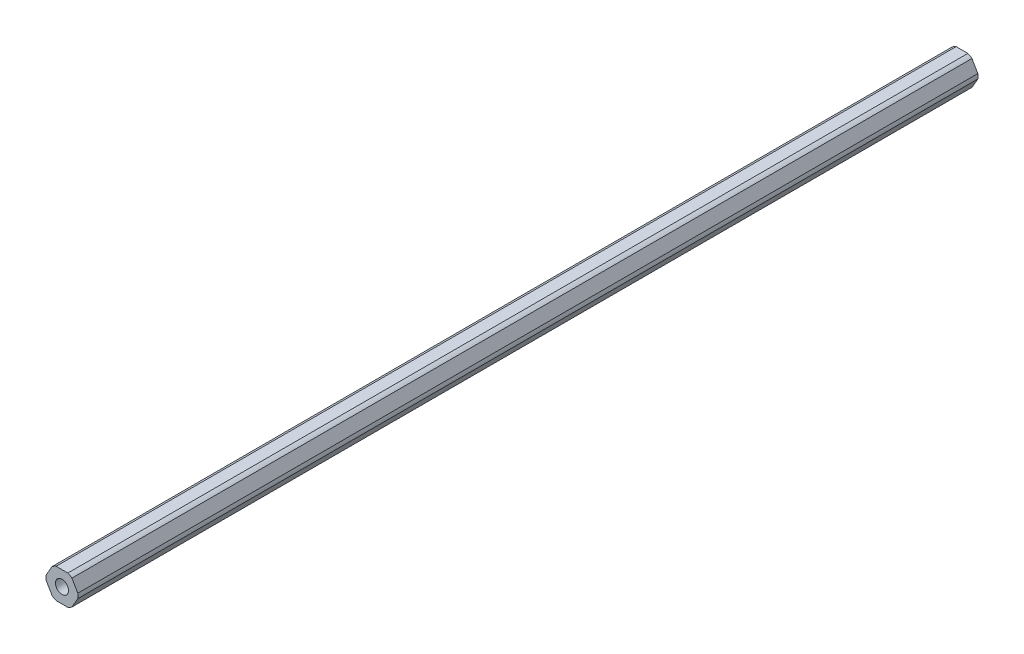
ISO-10303-21;
HEADER;
FILE_DESCRIPTION(('STEP AP214'),'2;1');
FILE_NAME('part.step','',(''),(''),'','','');
FILE_SCHEMA(('AUTOMOTIVE_DESIGN { 1 0 10303 214 1 1 1 1 }'));
ENDSEC;
DATA;
#1=APPLICATION_CONTEXT('core data for automotive mechanical design processes');
#2=APPLICATION_PROTOCOL_DEFINITION('international standard','automotive_design',2000,#1);
#3=PRODUCT_CONTEXT('',#1,'mechanical');
#4=PRODUCT('Part','Part','',(#3));
#5=PRODUCT_RELATED_PRODUCT_CATEGORY('part','',(#4));
#6=PRODUCT_DEFINITION_FORMATION('','',#4);
#7=PRODUCT_DEFINITION_CONTEXT('part definition',#1,'design');
#8=PRODUCT_DEFINITION('design','',#6,#7);
#9=PRODUCT_DEFINITION_SHAPE('','',#8);
#10=(LENGTH_UNIT() NAMED_UNIT(*) SI_UNIT(.MILLI.,.METRE.));
#11=(NAMED_UNIT(*) PLANE_ANGLE_UNIT() SI_UNIT($,.RADIAN.));
#12=(NAMED_UNIT(*) SI_UNIT($,.STERADIAN.) SOLID_ANGLE_UNIT());
#13=UNCERTAINTY_MEASURE_WITH_UNIT(LENGTH_MEASURE(1.E-05),#10,'distance_accuracy_value','');
#14=(GEOMETRIC_REPRESENTATION_CONTEXT(3) GLOBAL_UNCERTAINTY_ASSIGNED_CONTEXT((#13)) GLOBAL_UNIT_ASSIGNED_CONTEXT((#10,
#11,#12)) REPRESENTATION_CONTEXT('',''));
#15=CARTESIAN_POINT('',(0.,0.,0.));
#16=DIRECTION('',(0.,0.,1.));
#17=DIRECTION('',(1.,0.,0.));
#18=AXIS2_PLACEMENT_3D('',#15,#16,#17);
#19=CARTESIAN_POINT('',(2.74963065701564,-4.7625,457.2));
#20=DIRECTION('',(-0.866025403784442,0.5,0.));
#21=DIRECTION('',(0.,0.,1.));
#22=AXIS2_PLACEMENT_3D('',#19,#20,#21);
#23=PLANE('',#22);
#24=DIRECTION('',(0.499999999999991,0.866025403784444,0.));
#25=VECTOR('',#24,1.);
#26=CARTESIAN_POINT('',(3.18463300545771,-4.00905383108654,-304.8));
#27=LINE('',#26,#25);
#28=CARTESIAN_POINT('',(3.18463300545771,-4.00905383108654,-304.8));
#29=VERTEX_POINT('',#28);
#30=CARTESIAN_POINT('',(5.06425896558911,-0.753446168913433,-304.8));
#31=VERTEX_POINT('',#30);
#32=EDGE_CURVE('E238',#29,#31,#27,.T.);
#33=ORIENTED_EDGE('',*,*,#32,.F.);
#34=DIRECTION('',(0.,0.,1.));
#35=VECTOR('',#34,1.);
#36=CARTESIAN_POINT('',(3.1846330054577,-4.00905383108652,-457.2));
#37=LINE('',#36,#35);
#38=CARTESIAN_POINT('',(3.1846330054577,-4.00905383108653,-592.867499999751));
#39=VERTEX_POINT('',#38);
#40=EDGE_CURVE('E250',#39,#29,#37,.T.);
#41=ORIENTED_EDGE('',*,*,#40,.F.);
#42=DIRECTION('',(-0.499999999999995,-0.866025403784442,0.));
#43=VECTOR('',#42,1.);
#44=CARTESIAN_POINT('',(5.0642589655891,-0.753446168913447,-592.867499999751));
#45=LINE('',#44,#43);
#46=CARTESIAN_POINT('',(5.06425896558911,-0.753446168913432,-592.867499999751));
#47=VERTEX_POINT('',#46);
#48=EDGE_CURVE('E211',#47,#39,#45,.T.);
#49=ORIENTED_EDGE('',*,*,#48,.F.);
#50=DIRECTION('',(0.,0.,-1.));
#51=VECTOR('',#50,1.);
#52=CARTESIAN_POINT('',(5.06425896558911,-0.753446168913433,-457.2));
#53=LINE('',#52,#51);
#54=EDGE_CURVE('E270',#31,#47,#53,.T.);
#55=ORIENTED_EDGE('',*,*,#54,.F.);
#56=EDGE_LOOP('',(#33,#41,#49,#55));
#57=FACE_BOUND('',#56,.T.);
#58=ADVANCED_FACE('F49',(#57),#23,.F.);
#59=CARTESIAN_POINT('',(5.49926131403117,0.,457.2));
#60=DIRECTION('',(-0.866025403784438,-0.5,0.));
#61=DIRECTION('',(-0.5,0.866025403784438,0.));
#62=AXIS2_PLACEMENT_3D('',#59,#60,#61);
#63=PLANE('',#62);
#64=DIRECTION('',(-0.500000000000001,0.866025403784438,0.));
#65=VECTOR('',#64,1.);
#66=CARTESIAN_POINT('',(5.06425896558911,0.753446168913416,-304.8));
#67=LINE('',#66,#65);
#68=CARTESIAN_POINT('',(5.06425896558911,0.753446168913416,-304.8));
#69=VERTEX_POINT('',#68);
#70=CARTESIAN_POINT('',(3.18463300545762,4.00905383108658,-304.8));
#71=VERTEX_POINT('',#70);
#72=EDGE_CURVE('E66',#69,#71,#67,.T.);
#73=ORIENTED_EDGE('',*,*,#72,.F.);
#74=DIRECTION('',(0.,0.,1.));
#75=VECTOR('',#74,1.);
#76=CARTESIAN_POINT('',(5.06425896558911,0.753446168913412,-457.2));
#77=LINE('',#76,#75);
#78=CARTESIAN_POINT('',(5.06425896558911,0.753446168913415,-592.867499999751));
#79=VERTEX_POINT('',#78);
#80=EDGE_CURVE('E267',#79,#69,#77,.T.);
#81=ORIENTED_EDGE('',*,*,#80,.F.);
#82=DIRECTION('',(0.499999999999999,-0.866025403784439,0.));
#83=VECTOR('',#82,1.);
#84=CARTESIAN_POINT('',(3.18463300545762,4.00905383108659,-592.867499999751));
#85=LINE('',#84,#83);
#86=CARTESIAN_POINT('',(3.18463300545763,4.00905383108658,-592.867499999751));
#87=VERTEX_POINT('',#86);
#88=EDGE_CURVE('E182',#87,#79,#85,.T.);
#89=ORIENTED_EDGE('',*,*,#88,.F.);
#90=DIRECTION('',(0.,0.,-1.));
#91=VECTOR('',#90,1.);
#92=CARTESIAN_POINT('',(3.18463300545762,4.00905383108658,-457.2));
#93=LINE('',#92,#91);
#94=EDGE_CURVE('E171',#71,#87,#93,.T.);
#95=ORIENTED_EDGE('',*,*,#94,.F.);
#96=EDGE_LOOP('',(#73,#81,#89,#95));
#97=FACE_BOUND('',#96,.T.);
#98=ADVANCED_FACE('F299',(#97),#63,.F.);
#99=CARTESIAN_POINT('',(2.74963065701557,4.7625,457.2));
#100=DIRECTION('',(0.,-1.,0.));
#101=DIRECTION('',(0.,0.,-1.));
#102=AXIS2_PLACEMENT_3D('',#99,#100,#101);
#103=PLANE('',#102);
#104=DIRECTION('',(-1.,0.,0.));
#105=VECTOR('',#104,1.);
#106=CARTESIAN_POINT('',(1.87962596013146,4.76249999999999,-304.8));
#107=LINE('',#106,#105);
#108=CARTESIAN_POINT('',(1.87962596013146,4.76249999999999,-304.8));
#109=VERTEX_POINT('',#108);
#110=CARTESIAN_POINT('',(-1.8796259601315,4.7625,-304.8));
#111=VERTEX_POINT('',#110);
#112=EDGE_CURVE('E168',#109,#111,#107,.T.);
#113=ORIENTED_EDGE('',*,*,#112,.F.);
#114=DIRECTION('',(0.,0.,1.));
#115=VECTOR('',#114,1.);
#116=CARTESIAN_POINT('',(1.87962596013147,4.7625,-457.2));
#117=LINE('',#116,#115);
#118=CARTESIAN_POINT('',(1.87962596013146,4.76249999999999,-592.867499999751));
#119=VERTEX_POINT('',#118);
#120=EDGE_CURVE('E161',#119,#109,#117,.T.);
#121=ORIENTED_EDGE('',*,*,#120,.F.);
#122=DIRECTION('',(1.,0.,0.));
#123=VECTOR('',#122,1.);
#124=CARTESIAN_POINT('',(-1.87962596013152,4.76249999999999,-592.867499999751));
#125=LINE('',#124,#123);
#126=CARTESIAN_POINT('',(-1.8796259601315,4.76249999999999,-592.867499999751));
#127=VERTEX_POINT('',#126);
#128=EDGE_CURVE('E166',#127,#119,#125,.T.);
#129=ORIENTED_EDGE('',*,*,#128,.F.);
#130=DIRECTION('',(0.,0.,-1.));
#131=VECTOR('',#130,1.);
#132=CARTESIAN_POINT('',(-1.8796259601315,4.7625,-457.2));
#133=LINE('',#132,#131);
#134=EDGE_CURVE('E246',#111,#127,#133,.T.);
#135=ORIENTED_EDGE('',*,*,#134,.F.);
#136=EDGE_LOOP('',(#113,#121,#129,#135));
#137=FACE_BOUND('',#136,.T.);
#138=ADVANCED_FACE('F163',(#137),#103,.F.);
#139=CARTESIAN_POINT('',(-2.7496306570156,4.7625,457.2));
#140=DIRECTION('',(0.866025403784442,-0.5,0.));
#141=DIRECTION('',(0.,0.,-1.));
#142=AXIS2_PLACEMENT_3D('',#139,#140,#141);
#143=PLANE('',#142);
#144=DIRECTION('',(-0.499999999999993,-0.866025403784443,0.));
#145=VECTOR('',#144,1.);
#146=CARTESIAN_POINT('',(-3.18463300545766,4.00905383108656,-304.8));
#147=LINE('',#146,#145);
#148=CARTESIAN_POINT('',(-3.18463300545767,4.00905383108657,-304.8));
#149=VERTEX_POINT('',#148);
#150=CARTESIAN_POINT('',(-5.06425896558912,0.753446168913382,-304.8));
#151=VERTEX_POINT('',#150);
#152=EDGE_CURVE('E226',#149,#151,#147,.T.);
#153=ORIENTED_EDGE('',*,*,#152,.F.);
#154=DIRECTION('',(0.,0.,1.));
#155=VECTOR('',#154,1.);
#156=CARTESIAN_POINT('',(-3.18463300545766,4.00905383108655,-457.2));
#157=LINE('',#156,#155);
#158=CARTESIAN_POINT('',(-3.18463300545766,4.00905383108656,-592.867499999751));
#159=VERTEX_POINT('',#158);
#160=EDGE_CURVE('E253',#159,#149,#157,.T.);
#161=ORIENTED_EDGE('',*,*,#160,.F.);
#162=DIRECTION('',(0.499999999999995,0.866025403784441,0.));
#163=VECTOR('',#162,1.);
#164=CARTESIAN_POINT('',(-5.06425896558913,0.753446168913367,-592.867499999751));
#165=LINE('',#164,#163);
#166=CARTESIAN_POINT('',(-5.06425896558912,0.753446168913381,-592.867499999751));
#167=VERTEX_POINT('',#166);
#168=EDGE_CURVE('E190',#167,#159,#165,.T.);
#169=ORIENTED_EDGE('',*,*,#168,.F.);
#170=DIRECTION('',(0.,0.,-1.));
#171=VECTOR('',#170,1.);
#172=CARTESIAN_POINT('',(-5.06425896558912,0.753446168913382,-457.2));
#173=LINE('',#172,#171);
#174=EDGE_CURVE('E245',#151,#167,#173,.T.);
#175=ORIENTED_EDGE('',*,*,#174,.F.);
#176=EDGE_LOOP('',(#153,#161,#169,#175));
#177=FACE_BOUND('',#176,.T.);
#178=ADVANCED_FACE('F329',(#177),#143,.F.);
#179=CARTESIAN_POINT('',(-5.49926131403117,0.,457.2));
#180=DIRECTION('',(0.866025403784435,0.500000000000007,0.));
#181=DIRECTION('',(0.,0.,-1.));
#182=AXIS2_PLACEMENT_3D('',#179,#180,#181);
#183=PLANE('',#182);
#184=DIRECTION('',(0.500000000000007,-0.866025403784435,0.));
#185=VECTOR('',#184,1.);
#186=CARTESIAN_POINT('',(-5.06425896558911,-0.753446168913448,-304.8));
#187=LINE('',#186,#185);
#188=CARTESIAN_POINT('',(-5.06425896558911,-0.753446168913446,-304.8));
#189=VERTEX_POINT('',#188);
#190=CARTESIAN_POINT('',(-3.1846330054576,-4.0090538310866,-304.8));
#191=VERTEX_POINT('',#190);
#192=EDGE_CURVE('E230',#189,#191,#187,.T.);
#193=ORIENTED_EDGE('',*,*,#192,.F.);
#194=DIRECTION('',(0.,0.,1.));
#195=VECTOR('',#194,1.);
#196=CARTESIAN_POINT('',(-5.06425896558911,-0.75344616891345,-457.2));
#197=LINE('',#196,#195);
#198=CARTESIAN_POINT('',(-5.06425896558911,-0.75344616891345,-592.867499999751));
#199=VERTEX_POINT('',#198);
#200=EDGE_CURVE('E241',#199,#189,#197,.T.);
#201=ORIENTED_EDGE('',*,*,#200,.F.);
#202=DIRECTION('',(-0.500000000000007,0.866025403784434,0.));
#203=VECTOR('',#202,1.);
#204=CARTESIAN_POINT('',(-3.1846330054576,-4.00905383108659,-592.867499999751));
#205=LINE('',#204,#203);
#206=CARTESIAN_POINT('',(-3.1846330054576,-4.0090538310866,-592.867499999751));
#207=VERTEX_POINT('',#206);
#208=EDGE_CURVE('E199',#207,#199,#205,.T.);
#209=ORIENTED_EDGE('',*,*,#208,.F.);
#210=DIRECTION('',(0.,0.,-1.));
#211=VECTOR('',#210,1.);
#212=CARTESIAN_POINT('',(-3.1846330054576,-4.0090538310866,-457.2));
#213=LINE('',#212,#211);
#214=EDGE_CURVE('E251',#191,#207,#213,.T.);
#215=ORIENTED_EDGE('',*,*,#214,.F.);
#216=EDGE_LOOP('',(#193,#201,#209,#215));
#217=FACE_BOUND('',#216,.T.);
#218=ADVANCED_FACE('F320',(#217),#183,.F.);
#219=CARTESIAN_POINT('',(-2.74963065701554,-4.7625,457.2));
#220=DIRECTION('',(0.,1.,0.));
#221=DIRECTION('',(1.,0.,0.));
#222=AXIS2_PLACEMENT_3D('',#219,#220,#221);
#223=PLANE('',#222);
#224=DIRECTION('',(1.,0.,0.));
#225=VECTOR('',#224,1.);
#226=CARTESIAN_POINT('',(-1.87962596013144,-4.7625,-304.8));
#227=LINE('',#226,#225);
#228=CARTESIAN_POINT('',(-1.87962596013144,-4.7625,-304.8));
#229=VERTEX_POINT('',#228);
#230=CARTESIAN_POINT('',(1.87962596013154,-4.7625,-304.8));
#231=VERTEX_POINT('',#230);
#232=EDGE_CURVE('E234',#229,#231,#227,.T.);
#233=ORIENTED_EDGE('',*,*,#232,.F.);
#234=DIRECTION('',(0.,0.,1.));
#235=VECTOR('',#234,1.);
#236=CARTESIAN_POINT('',(-1.87962596013144,-4.7625,-457.2));
#237=LINE('',#236,#235);
#238=CARTESIAN_POINT('',(-1.87962596013143,-4.7625,-592.867499999751));
#239=VERTEX_POINT('',#238);
#240=EDGE_CURVE('E257',#239,#229,#237,.T.);
#241=ORIENTED_EDGE('',*,*,#240,.F.);
#242=DIRECTION('',(-1.,0.,0.));
#243=VECTOR('',#242,1.);
#244=CARTESIAN_POINT('',(1.8796259601315,-4.76249999999998,-592.867499999751));
#245=LINE('',#244,#243);
#246=CARTESIAN_POINT('',(1.87962596013153,-4.76249999999998,-592.867499999751));
#247=VERTEX_POINT('',#246);
#248=EDGE_CURVE('E205',#247,#239,#245,.T.);
#249=ORIENTED_EDGE('',*,*,#248,.F.);
#250=DIRECTION('',(0.,0.,-1.));
#251=VECTOR('',#250,1.);
#252=CARTESIAN_POINT('',(1.87962596013154,-4.7625,-457.2));
#253=LINE('',#252,#251);
#254=EDGE_CURVE('E247',#231,#247,#253,.T.);
#255=ORIENTED_EDGE('',*,*,#254,.F.);
#256=EDGE_LOOP('',(#233,#241,#249,#255));
#257=FACE_BOUND('',#256,.T.);
#258=ADVANCED_FACE('F312',(#257),#223,.F.);
#259=CARTESIAN_POINT('',(0.,0.,-457.2));
#260=DIRECTION('',(0.,0.,1.));
#261=DIRECTION('',(1.,0.,0.));
#262=AXIS2_PLACEMENT_3D('',#259,#260,#261);
#263=CYLINDRICAL_SURFACE('',#262,5.12);
#264=ORIENTED_EDGE('',*,*,#80,.T.);
#265=CARTESIAN_POINT('',(0.,0.,-304.8));
#266=DIRECTION('',(0.,0.,1.));
#267=DIRECTION('',(1.,0.,0.));
#268=AXIS2_PLACEMENT_3D('',#265,#266,#267);
#269=CIRCLE('',#268,5.12);
#270=CARTESIAN_POINT('',(5.12,0.,-304.8));
#271=VERTEX_POINT('',#270);
#272=EDGE_CURVE('E181',#271,#69,#269,.T.);
#273=ORIENTED_EDGE('',*,*,#272,.F.);
#274=DIRECTION('',(0.,0.,1.));
#275=VECTOR('',#274,1.);
#276=CARTESIAN_POINT('',(5.12,0.,-457.2));
#277=LINE('',#276,#275);
#278=CARTESIAN_POINT('',(5.12,0.,-457.2));
#279=VERTEX_POINT('',#278);
#280=EDGE_CURVE('E273',#279,#271,#277,.T.);
#281=ORIENTED_EDGE('',*,*,#280,.F.);
#282=ORIENTED_EDGE('',*,*,#280,.T.);
#283=EDGE_CURVE('E218',#31,#271,#269,.T.);
#284=ORIENTED_EDGE('',*,*,#283,.F.);
#285=ORIENTED_EDGE('',*,*,#54,.T.);
#286=CARTESIAN_POINT('',(0.,0.,-592.867499999751));
#287=DIRECTION('',(0.,0.,-1.));
#288=DIRECTION('',(-1.,0.,0.));
#289=AXIS2_PLACEMENT_3D('',#286,#287,#288);
#290=CIRCLE('',#289,5.12);
#291=EDGE_CURVE('E214',#79,#47,#290,.T.);
#292=ORIENTED_EDGE('',*,*,#291,.F.);
#293=EDGE_LOOP('',(#264,#273,#281,#282,#284,#285,#292));
#294=FACE_BOUND('',#293,.T.);
#295=ADVANCED_FACE('F51',(#294),#263,.T.);
#296=CARTESIAN_POINT('',(0.,0.,-457.2));
#297=DIRECTION('',(0.,0.,1.));
#298=DIRECTION('',(1.,0.,0.));
#299=AXIS2_PLACEMENT_3D('',#296,#297,#298);
#300=CYLINDRICAL_SURFACE('',#299,5.12);
#301=ORIENTED_EDGE('',*,*,#40,.T.);
#302=CARTESIAN_POINT('',(0.,0.,-304.8));
#303=DIRECTION('',(0.,0.,1.));
#304=DIRECTION('',(1.,0.,0.));
#305=AXIS2_PLACEMENT_3D('',#302,#303,#304);
#306=CIRCLE('',#305,5.12000000000003);
#307=EDGE_CURVE('E236',#231,#29,#306,.T.);
#308=ORIENTED_EDGE('',*,*,#307,.F.);
#309=ORIENTED_EDGE('',*,*,#254,.T.);
#310=CARTESIAN_POINT('',(0.,0.,-592.867499999751));
#311=DIRECTION('',(0.,0.,-1.));
#312=DIRECTION('',(-1.,0.,0.));
#313=AXIS2_PLACEMENT_3D('',#310,#311,#312);
#314=CIRCLE('',#313,5.12000000000001);
#315=EDGE_CURVE('E208',#39,#247,#314,.T.);
#316=ORIENTED_EDGE('',*,*,#315,.F.);
#317=EDGE_LOOP('',(#301,#308,#309,#316));
#318=FACE_BOUND('',#317,.T.);
#319=ADVANCED_FACE('F306',(#318),#300,.T.);
#320=CARTESIAN_POINT('',(0.,0.,-457.2));
#321=DIRECTION('',(0.,0.,1.));
#322=DIRECTION('',(1.,0.,0.));
#323=AXIS2_PLACEMENT_3D('',#320,#321,#322);
#324=CYLINDRICAL_SURFACE('',#323,5.12);
#325=ORIENTED_EDGE('',*,*,#240,.T.);
#326=CARTESIAN_POINT('',(0.,0.,-304.8));
#327=DIRECTION('',(0.,0.,1.));
#328=DIRECTION('',(1.,0.,0.));
#329=AXIS2_PLACEMENT_3D('',#326,#327,#328);
#330=CIRCLE('',#329,5.12);
#331=EDGE_CURVE('E232',#191,#229,#330,.T.);
#332=ORIENTED_EDGE('',*,*,#331,.F.);
#333=ORIENTED_EDGE('',*,*,#214,.T.);
#334=CARTESIAN_POINT('',(0.,0.,-592.867499999751));
#335=DIRECTION('',(0.,0.,-1.));
#336=DIRECTION('',(-1.,0.,0.));
#337=AXIS2_PLACEMENT_3D('',#334,#335,#336);
#338=CIRCLE('',#337,5.12);
#339=EDGE_CURVE('E202',#239,#207,#338,.T.);
#340=ORIENTED_EDGE('',*,*,#339,.F.);
#341=EDGE_LOOP('',(#325,#332,#333,#340));
#342=FACE_BOUND('',#341,.T.);
#343=ADVANCED_FACE('F315',(#342),#324,.T.);
#344=CARTESIAN_POINT('',(0.,0.,-457.2));
#345=DIRECTION('',(0.,0.,1.));
#346=DIRECTION('',(1.,0.,0.));
#347=AXIS2_PLACEMENT_3D('',#344,#345,#346);
#348=CYLINDRICAL_SURFACE('',#347,5.12);
#349=ORIENTED_EDGE('',*,*,#200,.T.);
#350=CARTESIAN_POINT('',(0.,0.,-304.8));
#351=DIRECTION('',(0.,0.,1.));
#352=DIRECTION('',(1.,0.,0.));
#353=AXIS2_PLACEMENT_3D('',#350,#351,#352);
#354=CIRCLE('',#353,5.12);
#355=EDGE_CURVE('E228',#151,#189,#354,.T.);
#356=ORIENTED_EDGE('',*,*,#355,.F.);
#357=ORIENTED_EDGE('',*,*,#174,.T.);
#358=CARTESIAN_POINT('',(0.,0.,-592.867499999751));
#359=DIRECTION('',(0.,0.,-1.));
#360=DIRECTION('',(-1.,0.,0.));
#361=AXIS2_PLACEMENT_3D('',#358,#359,#360);
#362=CIRCLE('',#361,5.12);
#363=EDGE_CURVE('E196',#199,#167,#362,.T.);
#364=ORIENTED_EDGE('',*,*,#363,.F.);
#365=EDGE_LOOP('',(#349,#356,#357,#364));
#366=FACE_BOUND('',#365,.T.);
#367=ADVANCED_FACE('F324',(#366),#348,.T.);
#368=CARTESIAN_POINT('',(0.,0.,-457.2));
#369=DIRECTION('',(0.,0.,1.));
#370=DIRECTION('',(1.,0.,0.));
#371=AXIS2_PLACEMENT_3D('',#368,#369,#370);
#372=CYLINDRICAL_SURFACE('',#371,5.12);
#373=ORIENTED_EDGE('',*,*,#160,.T.);
#374=CARTESIAN_POINT('',(0.,0.,-304.8));
#375=DIRECTION('',(0.,0.,1.));
#376=DIRECTION('',(1.,0.,0.));
#377=AXIS2_PLACEMENT_3D('',#374,#375,#376);
#378=CIRCLE('',#377,5.12000000000002);
#379=EDGE_CURVE('E224',#111,#149,#378,.T.);
#380=ORIENTED_EDGE('',*,*,#379,.F.);
#381=ORIENTED_EDGE('',*,*,#134,.T.);
#382=CARTESIAN_POINT('',(0.,0.,-592.867499999751));
#383=DIRECTION('',(0.,0.,-1.));
#384=DIRECTION('',(-1.,0.,0.));
#385=AXIS2_PLACEMENT_3D('',#382,#383,#384);
#386=CIRCLE('',#385,5.12000000000001);
#387=EDGE_CURVE('E187',#159,#127,#386,.T.);
#388=ORIENTED_EDGE('',*,*,#387,.F.);
#389=EDGE_LOOP('',(#373,#380,#381,#388));
#390=FACE_BOUND('',#389,.T.);
#391=ADVANCED_FACE('F332',(#390),#372,.T.);
#392=CARTESIAN_POINT('',(0.,0.,-457.2));
#393=DIRECTION('',(0.,0.,1.));
#394=DIRECTION('',(1.,0.,0.));
#395=AXIS2_PLACEMENT_3D('',#392,#393,#394);
#396=CYLINDRICAL_SURFACE('',#395,5.12);
#397=ORIENTED_EDGE('',*,*,#120,.T.);
#398=CARTESIAN_POINT('',(0.,0.,-304.8));
#399=DIRECTION('',(0.,0.,1.));
#400=DIRECTION('',(1.,0.,0.));
#401=AXIS2_PLACEMENT_3D('',#398,#399,#400);
#402=CIRCLE('',#401,5.12);
#403=EDGE_CURVE('E221',#71,#109,#402,.T.);
#404=ORIENTED_EDGE('',*,*,#403,.F.);
#405=ORIENTED_EDGE('',*,*,#94,.T.);
#406=CARTESIAN_POINT('',(0.,0.,-592.867499999751));
#407=DIRECTION('',(0.,0.,-1.));
#408=DIRECTION('',(-1.,0.,0.));
#409=AXIS2_PLACEMENT_3D('',#406,#407,#408);
#410=CIRCLE('',#409,5.12000000000001);
#411=EDGE_CURVE('E175',#119,#87,#410,.T.);
#412=ORIENTED_EDGE('',*,*,#411,.F.);
#413=EDGE_LOOP('',(#397,#404,#405,#412));
#414=FACE_BOUND('',#413,.T.);
#415=ADVANCED_FACE('F176',(#414),#396,.T.);
#416=CARTESIAN_POINT('',(0.,0.,-457.2));
#417=DIRECTION('',(0.,0.,1.));
#418=DIRECTION('',(1.,0.,0.));
#419=AXIS2_PLACEMENT_3D('',#416,#417,#418);
#420=CYLINDRICAL_SURFACE('',#419,2.1);
#421=CARTESIAN_POINT('',(0.,0.,-304.8));
#422=DIRECTION('',(0.,0.,1.));
#423=DIRECTION('',(1.,0.,0.));
#424=AXIS2_PLACEMENT_3D('',#421,#422,#423);
#425=CIRCLE('',#424,2.1);
#426=CARTESIAN_POINT('',(-2.1,0.,-304.8));
#427=VERTEX_POINT('',#426);
#428=CARTESIAN_POINT('',(2.1,0.,-304.8));
#429=VERTEX_POINT('',#428);
#430=EDGE_CURVE('E11',#427,#429,#425,.F.);
#431=ORIENTED_EDGE('',*,*,#430,.F.);
#432=DIRECTION('',(0.,0.,1.));
#433=VECTOR('',#432,1.);
#434=CARTESIAN_POINT('',(-2.1,0.,-457.2));
#435=LINE('',#434,#433);
#436=CARTESIAN_POINT('',(-2.1,0.,-457.2));
#437=VERTEX_POINT('',#436);
#438=EDGE_CURVE('E58',#437,#427,#435,.T.);
#439=ORIENTED_EDGE('',*,*,#438,.F.);
#440=ORIENTED_EDGE('',*,*,#438,.T.);
#441=CARTESIAN_POINT('',(0.,0.,-304.8));
#442=DIRECTION('',(0.,0.,1.));
#443=DIRECTION('',(1.,0.,0.));
#444=AXIS2_PLACEMENT_3D('',#441,#442,#443);
#445=CIRCLE('',#444,2.1);
#446=EDGE_CURVE('E72',#429,#427,#445,.F.);
#447=ORIENTED_EDGE('',*,*,#446,.F.);
#448=DIRECTION('',(0.,0.,1.));
#449=VECTOR('',#448,1.);
#450=CARTESIAN_POINT('',(2.1,0.,-457.2));
#451=LINE('',#450,#449);
#452=CARTESIAN_POINT('',(2.1,0.,-457.2));
#453=VERTEX_POINT('',#452);
#454=EDGE_CURVE('E172',#453,#429,#451,.T.);
#455=ORIENTED_EDGE('',*,*,#454,.F.);
#456=ORIENTED_EDGE('',*,*,#454,.T.);
#457=EDGE_LOOP('',(#431,#439,#440,#447,#455,#456));
#458=FACE_BOUND('',#457,.T.);
#459=CARTESIAN_POINT('',(0.,0.,-592.867499999751));
#460=DIRECTION('',(0.,0.,-1.));
#461=DIRECTION('',(-1.,0.,0.));
#462=AXIS2_PLACEMENT_3D('',#459,#460,#461);
#463=CIRCLE('',#462,2.1);
#464=CARTESIAN_POINT('',(-2.1,0.,-592.867499999751));
#465=VERTEX_POINT('',#464);
#466=EDGE_CURVE('E188',#465,#465,#463,.T.);
#467=ORIENTED_EDGE('',*,*,#466,.T.);
#468=EDGE_LOOP('',(#467));
#469=FACE_BOUND('',#468,.T.);
#470=ADVANCED_FACE('F339',(#458,#469),#420,.F.);
#471=CARTESIAN_POINT('',(0.,0.,-304.8));
#472=DIRECTION('',(0.,0.,1.));
#473=DIRECTION('',(1.,0.,0.));
#474=AXIS2_PLACEMENT_3D('',#471,#472,#473);
#475=PLANE('',#474);
#476=ORIENTED_EDGE('',*,*,#283,.T.);
#477=ORIENTED_EDGE('',*,*,#272,.T.);
#478=ORIENTED_EDGE('',*,*,#72,.T.);
#479=ORIENTED_EDGE('',*,*,#403,.T.);
#480=ORIENTED_EDGE('',*,*,#112,.T.);
#481=ORIENTED_EDGE('',*,*,#379,.T.);
#482=ORIENTED_EDGE('',*,*,#152,.T.);
#483=ORIENTED_EDGE('',*,*,#355,.T.);
#484=ORIENTED_EDGE('',*,*,#192,.T.);
#485=ORIENTED_EDGE('',*,*,#331,.T.);
#486=ORIENTED_EDGE('',*,*,#232,.T.);
#487=ORIENTED_EDGE('',*,*,#307,.T.);
#488=ORIENTED_EDGE('',*,*,#32,.T.);
#489=EDGE_LOOP('',(#476,#477,#478,#479,#480,#481,#482,#483,#484,#485,#486,#487,#488));
#490=FACE_BOUND('',#489,.T.);
#491=ORIENTED_EDGE('',*,*,#446,.T.);
#492=ORIENTED_EDGE('',*,*,#430,.T.);
#493=EDGE_LOOP('',(#491,#492));
#494=FACE_BOUND('',#493,.T.);
#495=ADVANCED_FACE('F297',(#490,#494),#475,.T.);
#496=CARTESIAN_POINT('',(-9.96837030172572,-4.63428316875012,-592.867499999751));
#497=DIRECTION('',(0.,0.,-1.));
#498=DIRECTION('',(0.500000000000007,-0.866025403784435,0.));
#499=AXIS2_PLACEMENT_3D('',#496,#497,#498);
#500=PLANE('',#499);
#501=ORIENTED_EDGE('',*,*,#466,.F.);
#502=EDGE_LOOP('',(#501));
#503=FACE_BOUND('',#502,.T.);
#504=ORIENTED_EDGE('',*,*,#128,.T.);
#505=ORIENTED_EDGE('',*,*,#411,.T.);
#506=ORIENTED_EDGE('',*,*,#88,.T.);
#507=ORIENTED_EDGE('',*,*,#291,.T.);
#508=ORIENTED_EDGE('',*,*,#48,.T.);
#509=ORIENTED_EDGE('',*,*,#315,.T.);
#510=ORIENTED_EDGE('',*,*,#248,.T.);
#511=ORIENTED_EDGE('',*,*,#339,.T.);
#512=ORIENTED_EDGE('',*,*,#208,.T.);
#513=ORIENTED_EDGE('',*,*,#363,.T.);
#514=ORIENTED_EDGE('',*,*,#168,.T.);
#515=ORIENTED_EDGE('',*,*,#387,.T.);
#516=EDGE_LOOP('',(#504,#505,#506,#507,#508,#509,#510,#511,#512,#513,#514,#515));
#517=FACE_BOUND('',#516,.T.);
#518=ADVANCED_FACE('F184',(#503,#517),#500,.T.);
#519=CLOSED_SHELL('',(#58,#98,#138,#178,#218,#258,#295,#319,#343,#367,#391,#415,#470,#495,#518));
#520=MANIFOLD_SOLID_BREP('B2',#519);
#521=ADVANCED_BREP_SHAPE_REPRESENTATION('',(#18,#520),#14);
#522=SHAPE_DEFINITION_REPRESENTATION(#9,#521);
ENDSEC;
END-ISO-10303-21;
